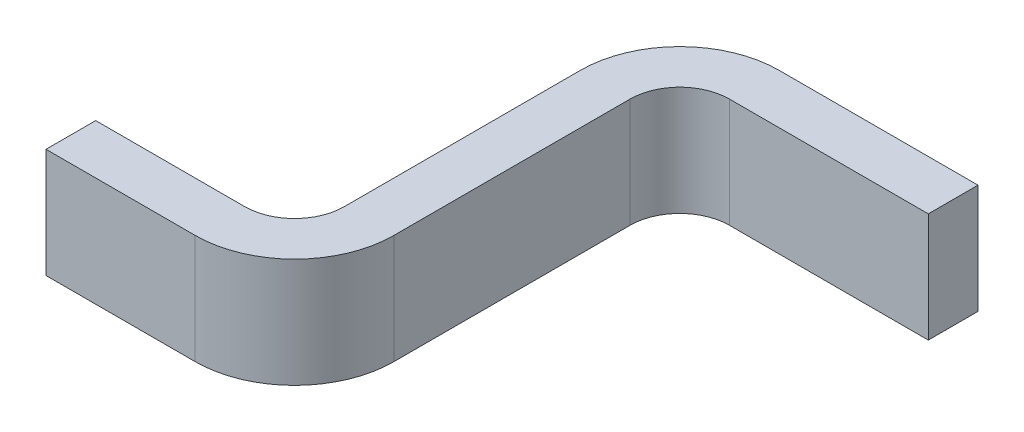
ISO-10303-21;
HEADER;
FILE_DESCRIPTION(('STEP AP214'),'2;1');
FILE_NAME('part.step','',(''),(''),'','','');
FILE_SCHEMA(('AUTOMOTIVE_DESIGN { 1 0 10303 214 1 1 1 1 }'));
ENDSEC;
DATA;
#1=APPLICATION_CONTEXT('core data for automotive mechanical design processes');
#2=APPLICATION_PROTOCOL_DEFINITION('international standard','automotive_design',2000,#1);
#3=PRODUCT_CONTEXT('',#1,'mechanical');
#4=PRODUCT('Part','Part','',(#3));
#5=PRODUCT_RELATED_PRODUCT_CATEGORY('part','',(#4));
#6=PRODUCT_DEFINITION_FORMATION('','',#4);
#7=PRODUCT_DEFINITION_CONTEXT('part definition',#1,'design');
#8=PRODUCT_DEFINITION('design','',#6,#7);
#9=PRODUCT_DEFINITION_SHAPE('','',#8);
#10=(LENGTH_UNIT() NAMED_UNIT(*) SI_UNIT(.MILLI.,.METRE.));
#11=(NAMED_UNIT(*) PLANE_ANGLE_UNIT() SI_UNIT($,.RADIAN.));
#12=(NAMED_UNIT(*) SI_UNIT($,.STERADIAN.) SOLID_ANGLE_UNIT());
#13=UNCERTAINTY_MEASURE_WITH_UNIT(LENGTH_MEASURE(1.E-05),#10,'distance_accuracy_value','');
#14=(GEOMETRIC_REPRESENTATION_CONTEXT(3) GLOBAL_UNCERTAINTY_ASSIGNED_CONTEXT((#13)) GLOBAL_UNIT_ASSIGNED_CONTEXT((#10,
#11,#12)) REPRESENTATION_CONTEXT('',''));
#15=CARTESIAN_POINT('',(0.,0.,0.));
#16=DIRECTION('',(0.,0.,1.));
#17=DIRECTION('',(1.,0.,0.));
#18=AXIS2_PLACEMENT_3D('',#15,#16,#17);
#19=CARTESIAN_POINT('',(3.9,-1.14,0.675));
#20=DIRECTION('',(0.,-1.,0.));
#21=DIRECTION('',(0.,0.,-1.));
#22=AXIS2_PLACEMENT_3D('',#19,#20,#21);
#23=PLANE('',#22);
#24=CARTESIAN_POINT('',(3.80000000000001,-1.14,0.675));
#25=DIRECTION('',(0.,-1.,0.));
#26=DIRECTION('',(0.,0.,-1.));
#27=AXIS2_PLACEMENT_3D('',#24,#25,#26);
#28=CIRCLE('',#27,0.1);
#29=CARTESIAN_POINT('',(3.9,-1.14,0.675));
#30=VERTEX_POINT('',#29);
#31=CARTESIAN_POINT('',(3.80000000000001,-1.14,0.775));
#32=VERTEX_POINT('',#31);
#33=EDGE_CURVE('E162',#30,#32,#28,.T.);
#34=ORIENTED_EDGE('',*,*,#33,.T.);
#35=DIRECTION('',(1.,0.,0.));
#36=VECTOR('',#35,1.);
#37=CARTESIAN_POINT('',(3.5,-1.14,0.775));
#38=LINE('',#37,#36);
#39=CARTESIAN_POINT('',(3.5,-1.14,0.775));
#40=VERTEX_POINT('',#39);
#41=EDGE_CURVE('E120',#32,#40,#38,.F.);
#42=ORIENTED_EDGE('',*,*,#41,.T.);
#43=DIRECTION('',(0.,0.,1.));
#44=VECTOR('',#43,1.);
#45=CARTESIAN_POINT('',(3.5,-1.14,0.775));
#46=LINE('',#45,#44);
#47=CARTESIAN_POINT('',(3.5,-1.14,0.875));
#48=VERTEX_POINT('',#47);
#49=EDGE_CURVE('E116',#48,#40,#46,.F.);
#50=ORIENTED_EDGE('',*,*,#49,.F.);
#51=DIRECTION('',(-1.,0.,0.));
#52=VECTOR('',#51,1.);
#53=CARTESIAN_POINT('',(3.5,-1.14,0.875));
#54=LINE('',#53,#52);
#55=CARTESIAN_POINT('',(3.80000000000001,-1.14,0.875));
#56=VERTEX_POINT('',#55);
#57=EDGE_CURVE('E111',#48,#56,#54,.F.);
#58=ORIENTED_EDGE('',*,*,#57,.T.);
#59=CARTESIAN_POINT('',(3.80000000000001,-1.14,0.675));
#60=DIRECTION('',(0.,-1.,0.));
#61=DIRECTION('',(0.,0.,-1.));
#62=AXIS2_PLACEMENT_3D('',#59,#60,#61);
#63=CIRCLE('',#62,0.2);
#64=CARTESIAN_POINT('',(4.,-1.14,0.675));
#65=VERTEX_POINT('',#64);
#66=EDGE_CURVE('E102',#65,#56,#63,.T.);
#67=ORIENTED_EDGE('',*,*,#66,.F.);
#68=DIRECTION('',(0.,0.,1.));
#69=VECTOR('',#68,1.);
#70=CARTESIAN_POINT('',(4.,-1.14,0.675));
#71=LINE('',#70,#69);
#72=CARTESIAN_POINT('',(4.,-1.14,0.2));
#73=VERTEX_POINT('',#72);
#74=EDGE_CURVE('E98',#65,#73,#71,.F.);
#75=ORIENTED_EDGE('',*,*,#74,.T.);
#76=CARTESIAN_POINT('',(4.1,-1.14,0.2));
#77=DIRECTION('',(0.,1.,0.));
#78=DIRECTION('',(0.,0.,1.));
#79=AXIS2_PLACEMENT_3D('',#76,#77,#78);
#80=CIRCLE('',#79,0.1);
#81=CARTESIAN_POINT('',(4.1,-1.14,0.1));
#82=VERTEX_POINT('',#81);
#83=EDGE_CURVE('E20',#73,#82,#80,.F.);
#84=ORIENTED_EDGE('',*,*,#83,.T.);
#85=DIRECTION('',(-1.,0.,0.));
#86=VECTOR('',#85,1.);
#87=CARTESIAN_POINT('',(4.1,-1.14,0.1));
#88=LINE('',#87,#86);
#89=CARTESIAN_POINT('',(4.5,-1.14,0.1));
#90=VERTEX_POINT('',#89);
#91=EDGE_CURVE('E145',#82,#90,#88,.F.);
#92=ORIENTED_EDGE('',*,*,#91,.T.);
#93=DIRECTION('',(0.,0.,1.));
#94=VECTOR('',#93,1.);
#95=CARTESIAN_POINT('',(4.5,-1.14,0.));
#96=LINE('',#95,#94);
#97=CARTESIAN_POINT('',(4.5,-1.14,0.));
#98=VERTEX_POINT('',#97);
#99=EDGE_CURVE('E139',#90,#98,#96,.F.);
#100=ORIENTED_EDGE('',*,*,#99,.T.);
#101=DIRECTION('',(1.,0.,0.));
#102=VECTOR('',#101,1.);
#103=CARTESIAN_POINT('',(4.1,-1.14,0.));
#104=LINE('',#103,#102);
#105=CARTESIAN_POINT('',(4.1,-1.14,0.));
#106=VERTEX_POINT('',#105);
#107=EDGE_CURVE('E132',#98,#106,#104,.F.);
#108=ORIENTED_EDGE('',*,*,#107,.T.);
#109=CARTESIAN_POINT('',(4.1,-1.14,0.2));
#110=DIRECTION('',(0.,1.,0.));
#111=DIRECTION('',(0.,0.,1.));
#112=AXIS2_PLACEMENT_3D('',#109,#110,#111);
#113=CIRCLE('',#112,0.2);
#114=CARTESIAN_POINT('',(3.9,-1.14,0.2));
#115=VERTEX_POINT('',#114);
#116=EDGE_CURVE('E135',#115,#106,#113,.F.);
#117=ORIENTED_EDGE('',*,*,#116,.F.);
#118=DIRECTION('',(0.,0.,-1.));
#119=VECTOR('',#118,1.);
#120=CARTESIAN_POINT('',(3.9,-1.14,0.675));
#121=LINE('',#120,#119);
#122=EDGE_CURVE('E128',#115,#30,#121,.F.);
#123=ORIENTED_EDGE('',*,*,#122,.T.);
#124=EDGE_LOOP('',(#34,#42,#50,#58,#67,#75,#84,#92,#100,#108,#117,#123));
#125=FACE_BOUND('',#124,.T.);
#126=ADVANCED_FACE('F17',(#125),#23,.F.);
#127=CARTESIAN_POINT('',(4.1,-1.14,0.2));
#128=DIRECTION('',(0.,1.,0.));
#129=DIRECTION('',(0.,0.,1.));
#130=AXIS2_PLACEMENT_3D('',#127,#128,#129);
#131=CYLINDRICAL_SURFACE('',#130,0.1);
#132=DIRECTION('',(0.,1.,0.));
#133=VECTOR('',#132,1.);
#134=CARTESIAN_POINT('',(4.,-1.14,0.2));
#135=LINE('',#134,#133);
#136=CARTESIAN_POINT('',(4.,-1.36,0.2));
#137=VERTEX_POINT('',#136);
#138=EDGE_CURVE('E91',#73,#137,#135,.F.);
#139=ORIENTED_EDGE('',*,*,#138,.T.);
#140=CARTESIAN_POINT('',(4.1,-1.36,0.2));
#141=DIRECTION('',(0.,1.,0.));
#142=DIRECTION('',(0.,0.,1.));
#143=AXIS2_PLACEMENT_3D('',#140,#141,#142);
#144=CIRCLE('',#143,0.1);
#145=CARTESIAN_POINT('',(4.1,-1.36,0.1));
#146=VERTEX_POINT('',#145);
#147=EDGE_CURVE('E103',#137,#146,#144,.F.);
#148=ORIENTED_EDGE('',*,*,#147,.T.);
#149=DIRECTION('',(0.,1.,0.));
#150=VECTOR('',#149,1.);
#151=CARTESIAN_POINT('',(4.1,-1.14,0.1));
#152=LINE('',#151,#150);
#153=EDGE_CURVE('E92',#146,#82,#152,.T.);
#154=ORIENTED_EDGE('',*,*,#153,.T.);
#155=ORIENTED_EDGE('',*,*,#83,.F.);
#156=EDGE_LOOP('',(#139,#148,#154,#155));
#157=FACE_BOUND('',#156,.T.);
#158=ADVANCED_FACE('F89',(#157),#131,.F.);
#159=CARTESIAN_POINT('',(4.1,-1.14,0.1));
#160=DIRECTION('',(0.,0.,-1.));
#161=DIRECTION('',(-1.,0.,0.));
#162=AXIS2_PLACEMENT_3D('',#159,#160,#161);
#163=PLANE('',#162);
#164=ORIENTED_EDGE('',*,*,#153,.F.);
#165=DIRECTION('',(1.,0.,0.));
#166=VECTOR('',#165,1.);
#167=CARTESIAN_POINT('',(4.,-1.36,0.1));
#168=LINE('',#167,#166);
#169=CARTESIAN_POINT('',(4.5,-1.36,0.1));
#170=VERTEX_POINT('',#169);
#171=EDGE_CURVE('E105',#146,#170,#168,.T.);
#172=ORIENTED_EDGE('',*,*,#171,.T.);
#173=DIRECTION('',(0.,1.,0.));
#174=VECTOR('',#173,1.);
#175=CARTESIAN_POINT('',(4.5,-1.36,0.1));
#176=LINE('',#175,#174);
#177=EDGE_CURVE('E142',#170,#90,#176,.T.);
#178=ORIENTED_EDGE('',*,*,#177,.T.);
#179=ORIENTED_EDGE('',*,*,#91,.F.);
#180=EDGE_LOOP('',(#164,#172,#178,#179));
#181=FACE_BOUND('',#180,.T.);
#182=ADVANCED_FACE('F187',(#181),#163,.F.);
#183=CARTESIAN_POINT('',(4.5,-1.36,0.));
#184=DIRECTION('',(-1.,0.,0.));
#185=DIRECTION('',(0.,0.,1.));
#186=AXIS2_PLACEMENT_3D('',#183,#184,#185);
#187=PLANE('',#186);
#188=ORIENTED_EDGE('',*,*,#177,.F.);
#189=DIRECTION('',(0.,0.,1.));
#190=VECTOR('',#189,1.);
#191=CARTESIAN_POINT('',(4.5,-1.36,0.675));
#192=LINE('',#191,#190);
#193=CARTESIAN_POINT('',(4.5,-1.36,0.));
#194=VERTEX_POINT('',#193);
#195=EDGE_CURVE('E176',#170,#194,#192,.F.);
#196=ORIENTED_EDGE('',*,*,#195,.T.);
#197=DIRECTION('',(0.,1.,0.));
#198=VECTOR('',#197,1.);
#199=CARTESIAN_POINT('',(4.5,-1.36,0.));
#200=LINE('',#199,#198);
#201=EDGE_CURVE('E136',#194,#98,#200,.T.);
#202=ORIENTED_EDGE('',*,*,#201,.T.);
#203=ORIENTED_EDGE('',*,*,#99,.F.);
#204=EDGE_LOOP('',(#188,#196,#202,#203));
#205=FACE_BOUND('',#204,.T.);
#206=ADVANCED_FACE('F192',(#205),#187,.F.);
#207=CARTESIAN_POINT('',(4.1,-1.36,0.));
#208=DIRECTION('',(0.,0.,1.));
#209=DIRECTION('',(1.,0.,0.));
#210=AXIS2_PLACEMENT_3D('',#207,#208,#209);
#211=PLANE('',#210);
#212=DIRECTION('',(0.,1.,0.));
#213=VECTOR('',#212,1.);
#214=CARTESIAN_POINT('',(4.1,-1.36,0.));
#215=LINE('',#214,#213);
#216=CARTESIAN_POINT('',(4.1,-1.36,0.));
#217=VERTEX_POINT('',#216);
#218=EDGE_CURVE('E163',#106,#217,#215,.F.);
#219=ORIENTED_EDGE('',*,*,#218,.F.);
#220=ORIENTED_EDGE('',*,*,#107,.F.);
#221=ORIENTED_EDGE('',*,*,#201,.F.);
#222=DIRECTION('',(1.,0.,0.));
#223=VECTOR('',#222,1.);
#224=CARTESIAN_POINT('',(4.,-1.36,0.));
#225=LINE('',#224,#223);
#226=EDGE_CURVE('E159',#194,#217,#225,.F.);
#227=ORIENTED_EDGE('',*,*,#226,.T.);
#228=EDGE_LOOP('',(#219,#220,#221,#227));
#229=FACE_BOUND('',#228,.T.);
#230=ADVANCED_FACE('F264',(#229),#211,.F.);
#231=CARTESIAN_POINT('',(4.1,-1.36,0.2));
#232=DIRECTION('',(0.,1.,0.));
#233=DIRECTION('',(0.,0.,1.));
#234=AXIS2_PLACEMENT_3D('',#231,#232,#233);
#235=CYLINDRICAL_SURFACE('',#234,0.2);
#236=ORIENTED_EDGE('',*,*,#116,.T.);
#237=ORIENTED_EDGE('',*,*,#218,.T.);
#238=CARTESIAN_POINT('',(4.1,-1.36,0.2));
#239=DIRECTION('',(0.,1.,0.));
#240=DIRECTION('',(0.,0.,1.));
#241=AXIS2_PLACEMENT_3D('',#238,#239,#240);
#242=CIRCLE('',#241,0.2);
#243=CARTESIAN_POINT('',(3.9,-1.36,0.2));
#244=VERTEX_POINT('',#243);
#245=EDGE_CURVE('E157',#217,#244,#242,.T.);
#246=ORIENTED_EDGE('',*,*,#245,.T.);
#247=DIRECTION('',(0.,1.,0.));
#248=VECTOR('',#247,1.);
#249=CARTESIAN_POINT('',(3.9,-1.36,0.2));
#250=LINE('',#249,#248);
#251=EDGE_CURVE('E131',#244,#115,#250,.T.);
#252=ORIENTED_EDGE('',*,*,#251,.T.);
#253=EDGE_LOOP('',(#236,#237,#246,#252));
#254=FACE_BOUND('',#253,.T.);
#255=ADVANCED_FACE('F266',(#254),#235,.T.);
#256=CARTESIAN_POINT('',(3.9,-1.36,0.675));
#257=DIRECTION('',(1.,0.,0.));
#258=DIRECTION('',(0.,0.,-1.));
#259=AXIS2_PLACEMENT_3D('',#256,#257,#258);
#260=PLANE('',#259);
#261=DIRECTION('',(0.,-1.,0.));
#262=VECTOR('',#261,1.);
#263=CARTESIAN_POINT('',(3.9,-1.36,0.675));
#264=LINE('',#263,#262);
#265=CARTESIAN_POINT('',(3.9,-1.36,0.675));
#266=VERTEX_POINT('',#265);
#267=EDGE_CURVE('E130',#266,#30,#264,.F.);
#268=ORIENTED_EDGE('',*,*,#267,.T.);
#269=ORIENTED_EDGE('',*,*,#122,.F.);
#270=ORIENTED_EDGE('',*,*,#251,.F.);
#271=DIRECTION('',(0.,0.,1.));
#272=VECTOR('',#271,1.);
#273=CARTESIAN_POINT('',(3.9,-1.36,0.675));
#274=LINE('',#273,#272);
#275=EDGE_CURVE('E156',#244,#266,#274,.T.);
#276=ORIENTED_EDGE('',*,*,#275,.T.);
#277=EDGE_LOOP('',(#268,#269,#270,#276));
#278=FACE_BOUND('',#277,.T.);
#279=ADVANCED_FACE('F231',(#278),#260,.F.);
#280=CARTESIAN_POINT('',(3.8,-1.36,0.675));
#281=DIRECTION('',(0.,-1.,0.));
#282=DIRECTION('',(0.,0.,-1.));
#283=AXIS2_PLACEMENT_3D('',#280,#281,#282);
#284=CYLINDRICAL_SURFACE('',#283,0.1);
#285=DIRECTION('',(0.,1.,0.));
#286=VECTOR('',#285,1.);
#287=CARTESIAN_POINT('',(3.8,-1.36,0.775));
#288=LINE('',#287,#286);
#289=CARTESIAN_POINT('',(3.8,-1.36,0.775));
#290=VERTEX_POINT('',#289);
#291=EDGE_CURVE('E125',#290,#32,#288,.T.);
#292=ORIENTED_EDGE('',*,*,#291,.T.);
#293=ORIENTED_EDGE('',*,*,#33,.F.);
#294=ORIENTED_EDGE('',*,*,#267,.F.);
#295=CARTESIAN_POINT('',(3.8,-1.36,0.675));
#296=DIRECTION('',(0.,-1.,0.));
#297=DIRECTION('',(0.,0.,-1.));
#298=AXIS2_PLACEMENT_3D('',#295,#296,#297);
#299=CIRCLE('',#298,0.1);
#300=EDGE_CURVE('E152',#266,#290,#299,.T.);
#301=ORIENTED_EDGE('',*,*,#300,.T.);
#302=EDGE_LOOP('',(#292,#293,#294,#301));
#303=FACE_BOUND('',#302,.T.);
#304=ADVANCED_FACE('F235',(#303),#284,.F.);
#305=CARTESIAN_POINT('',(3.5,-1.36,0.775));
#306=DIRECTION('',(0.,0.,1.));
#307=DIRECTION('',(1.,0.,0.));
#308=AXIS2_PLACEMENT_3D('',#305,#306,#307);
#309=PLANE('',#308);
#310=DIRECTION('',(0.,1.,0.));
#311=VECTOR('',#310,1.);
#312=CARTESIAN_POINT('',(3.5,-1.36,0.775));
#313=LINE('',#312,#311);
#314=CARTESIAN_POINT('',(3.5,-1.36,0.775));
#315=VERTEX_POINT('',#314);
#316=EDGE_CURVE('E119',#40,#315,#313,.F.);
#317=ORIENTED_EDGE('',*,*,#316,.F.);
#318=ORIENTED_EDGE('',*,*,#41,.F.);
#319=ORIENTED_EDGE('',*,*,#291,.F.);
#320=DIRECTION('',(1.,0.,0.));
#321=VECTOR('',#320,1.);
#322=CARTESIAN_POINT('',(4.,-1.36,0.775));
#323=LINE('',#322,#321);
#324=EDGE_CURVE('E155',#290,#315,#323,.F.);
#325=ORIENTED_EDGE('',*,*,#324,.T.);
#326=EDGE_LOOP('',(#317,#318,#319,#325));
#327=FACE_BOUND('',#326,.T.);
#328=ADVANCED_FACE('F259',(#327),#309,.F.);
#329=CARTESIAN_POINT('',(3.5,-1.36,0.775));
#330=DIRECTION('',(-1.,0.,0.));
#331=DIRECTION('',(0.,0.,1.));
#332=AXIS2_PLACEMENT_3D('',#329,#330,#331);
#333=PLANE('',#332);
#334=DIRECTION('',(0.,0.,1.));
#335=VECTOR('',#334,1.);
#336=CARTESIAN_POINT('',(3.5,-1.36,0.675));
#337=LINE('',#336,#335);
#338=CARTESIAN_POINT('',(3.5,-1.36,0.875));
#339=VERTEX_POINT('',#338);
#340=EDGE_CURVE('E217',#315,#339,#337,.T.);
#341=ORIENTED_EDGE('',*,*,#340,.T.);
#342=DIRECTION('',(0.,1.,0.));
#343=VECTOR('',#342,1.);
#344=CARTESIAN_POINT('',(3.5,-1.14,0.875));
#345=LINE('',#344,#343);
#346=EDGE_CURVE('E113',#339,#48,#345,.T.);
#347=ORIENTED_EDGE('',*,*,#346,.T.);
#348=ORIENTED_EDGE('',*,*,#49,.T.);
#349=ORIENTED_EDGE('',*,*,#316,.T.);
#350=EDGE_LOOP('',(#341,#347,#348,#349));
#351=FACE_BOUND('',#350,.T.);
#352=ADVANCED_FACE('F255',(#351),#333,.T.);
#353=CARTESIAN_POINT('',(3.5,-1.14,0.875));
#354=DIRECTION('',(0.,0.,-1.));
#355=DIRECTION('',(-1.,0.,0.));
#356=AXIS2_PLACEMENT_3D('',#353,#354,#355);
#357=PLANE('',#356);
#358=ORIENTED_EDGE('',*,*,#346,.F.);
#359=DIRECTION('',(1.,0.,0.));
#360=VECTOR('',#359,1.);
#361=CARTESIAN_POINT('',(4.,-1.36,0.875));
#362=LINE('',#361,#360);
#363=CARTESIAN_POINT('',(3.8,-1.36,0.875));
#364=VERTEX_POINT('',#363);
#365=EDGE_CURVE('E151',#339,#364,#362,.T.);
#366=ORIENTED_EDGE('',*,*,#365,.T.);
#367=DIRECTION('',(0.,-1.,0.));
#368=VECTOR('',#367,1.);
#369=CARTESIAN_POINT('',(3.80000000000001,-1.14,0.875));
#370=LINE('',#369,#368);
#371=EDGE_CURVE('E99',#56,#364,#370,.T.);
#372=ORIENTED_EDGE('',*,*,#371,.F.);
#373=ORIENTED_EDGE('',*,*,#57,.F.);
#374=EDGE_LOOP('',(#358,#366,#372,#373));
#375=FACE_BOUND('',#374,.T.);
#376=ADVANCED_FACE('F251',(#375),#357,.F.);
#377=CARTESIAN_POINT('',(3.80000000000001,-1.14,0.675));
#378=DIRECTION('',(0.,-1.,0.));
#379=DIRECTION('',(0.,0.,-1.));
#380=AXIS2_PLACEMENT_3D('',#377,#378,#379);
#381=CYLINDRICAL_SURFACE('',#380,0.2);
#382=CARTESIAN_POINT('',(3.8,-1.36,0.675));
#383=DIRECTION('',(0.,-1.,0.));
#384=DIRECTION('',(0.,0.,-1.));
#385=AXIS2_PLACEMENT_3D('',#382,#383,#384);
#386=CIRCLE('',#385,0.2);
#387=CARTESIAN_POINT('',(4.,-1.36,0.675));
#388=VERTEX_POINT('',#387);
#389=EDGE_CURVE('E26',#364,#388,#386,.F.);
#390=ORIENTED_EDGE('',*,*,#389,.T.);
#391=DIRECTION('',(0.,1.,0.));
#392=VECTOR('',#391,1.);
#393=CARTESIAN_POINT('',(4.,-1.14,0.675));
#394=LINE('',#393,#392);
#395=EDGE_CURVE('E34',#388,#65,#394,.T.);
#396=ORIENTED_EDGE('',*,*,#395,.T.);
#397=ORIENTED_EDGE('',*,*,#66,.T.);
#398=ORIENTED_EDGE('',*,*,#371,.T.);
#399=EDGE_LOOP('',(#390,#396,#397,#398));
#400=FACE_BOUND('',#399,.T.);
#401=ADVANCED_FACE('F280',(#400),#381,.T.);
#402=CARTESIAN_POINT('',(4.,-1.14,0.675));
#403=DIRECTION('',(-1.,0.,0.));
#404=DIRECTION('',(0.,0.,1.));
#405=AXIS2_PLACEMENT_3D('',#402,#403,#404);
#406=PLANE('',#405);
#407=ORIENTED_EDGE('',*,*,#395,.F.);
#408=DIRECTION('',(0.,0.,1.));
#409=VECTOR('',#408,1.);
#410=CARTESIAN_POINT('',(4.,-1.36,0.675));
#411=LINE('',#410,#409);
#412=EDGE_CURVE('E11',#388,#137,#411,.F.);
#413=ORIENTED_EDGE('',*,*,#412,.T.);
#414=ORIENTED_EDGE('',*,*,#138,.F.);
#415=ORIENTED_EDGE('',*,*,#74,.F.);
#416=EDGE_LOOP('',(#407,#413,#414,#415));
#417=FACE_BOUND('',#416,.T.);
#418=ADVANCED_FACE('F97',(#417),#406,.F.);
#419=CARTESIAN_POINT('',(4.,-1.36,0.675));
#420=DIRECTION('',(0.,1.,0.));
#421=DIRECTION('',(0.,0.,1.));
#422=AXIS2_PLACEMENT_3D('',#419,#420,#421);
#423=PLANE('',#422);
#424=ORIENTED_EDGE('',*,*,#389,.F.);
#425=ORIENTED_EDGE('',*,*,#365,.F.);
#426=ORIENTED_EDGE('',*,*,#340,.F.);
#427=ORIENTED_EDGE('',*,*,#324,.F.);
#428=ORIENTED_EDGE('',*,*,#300,.F.);
#429=ORIENTED_EDGE('',*,*,#275,.F.);
#430=ORIENTED_EDGE('',*,*,#245,.F.);
#431=ORIENTED_EDGE('',*,*,#226,.F.);
#432=ORIENTED_EDGE('',*,*,#195,.F.);
#433=ORIENTED_EDGE('',*,*,#171,.F.);
#434=ORIENTED_EDGE('',*,*,#147,.F.);
#435=ORIENTED_EDGE('',*,*,#412,.F.);
#436=EDGE_LOOP('',(#424,#425,#426,#427,#428,#429,#430,#431,#432,#433,#434,#435));
#437=FACE_BOUND('',#436,.T.);
#438=ADVANCED_FACE('F197',(#437),#423,.F.);
#439=CLOSED_SHELL('',(#126,#158,#182,#206,#230,#255,#279,#304,#328,#352,#376,#401,#418,#438));
#440=MANIFOLD_SOLID_BREP('B1',#439);
#441=ADVANCED_BREP_SHAPE_REPRESENTATION('',(#18,#440),#14);
#442=SHAPE_DEFINITION_REPRESENTATION(#9,#441);
ENDSEC;
END-ISO-10303-21;
